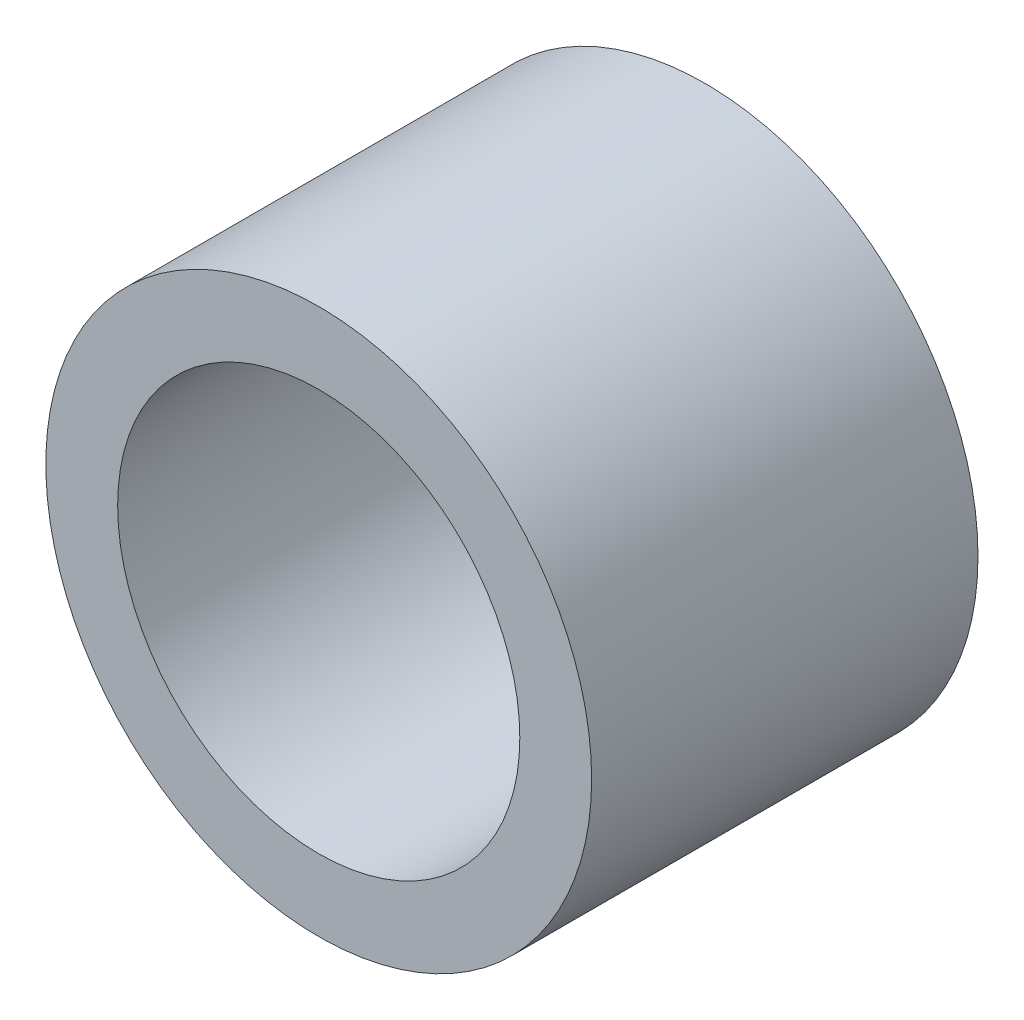
ISO-10303-21;
HEADER;
FILE_DESCRIPTION(('STEP AP214'),'2;1');
FILE_NAME('part.step','',(''),(''),'','','');
FILE_SCHEMA(('AUTOMOTIVE_DESIGN { 1 0 10303 214 1 1 1 1 }'));
ENDSEC;
DATA;
#1=APPLICATION_CONTEXT('core data for automotive mechanical design processes');
#2=APPLICATION_PROTOCOL_DEFINITION('international standard','automotive_design',2000,#1);
#3=PRODUCT_CONTEXT('',#1,'mechanical');
#4=PRODUCT('Part','Part','',(#3));
#5=PRODUCT_RELATED_PRODUCT_CATEGORY('part','',(#4));
#6=PRODUCT_DEFINITION_FORMATION('','',#4);
#7=PRODUCT_DEFINITION_CONTEXT('part definition',#1,'design');
#8=PRODUCT_DEFINITION('design','',#6,#7);
#9=PRODUCT_DEFINITION_SHAPE('','',#8);
#10=(LENGTH_UNIT() NAMED_UNIT(*) SI_UNIT(.MILLI.,.METRE.));
#11=(NAMED_UNIT(*) PLANE_ANGLE_UNIT() SI_UNIT($,.RADIAN.));
#12=(NAMED_UNIT(*) SI_UNIT($,.STERADIAN.) SOLID_ANGLE_UNIT());
#13=UNCERTAINTY_MEASURE_WITH_UNIT(LENGTH_MEASURE(1.E-05),#10,'distance_accuracy_value','');
#14=(GEOMETRIC_REPRESENTATION_CONTEXT(3) GLOBAL_UNCERTAINTY_ASSIGNED_CONTEXT((#13)) GLOBAL_UNIT_ASSIGNED_CONTEXT((#10,
#11,#12)) REPRESENTATION_CONTEXT('',''));
#15=CARTESIAN_POINT('',(0.,0.,0.));
#16=DIRECTION('',(0.,0.,1.));
#17=DIRECTION('',(1.,0.,0.));
#18=AXIS2_PLACEMENT_3D('',#15,#16,#17);
#19=CARTESIAN_POINT('',(0.,0.,6.8326));
#20=DIRECTION('',(0.,0.,1.));
#21=DIRECTION('',(1.,0.,0.));
#22=AXIS2_PLACEMENT_3D('',#19,#20,#21);
#23=PLANE('',#22);
#24=CARTESIAN_POINT('',(0.,0.,6.8326));
#25=DIRECTION('',(0.,0.,1.));
#26=DIRECTION('',(1.,0.,0.));
#27=AXIS2_PLACEMENT_3D('',#24,#25,#26);
#28=CIRCLE('',#27,4.826);
#29=CARTESIAN_POINT('',(4.826,0.,6.8326));
#30=VERTEX_POINT('',#29);
#31=EDGE_CURVE('E10',#30,#30,#28,.T.);
#32=ORIENTED_EDGE('',*,*,#31,.T.);
#33=EDGE_LOOP('',(#32));
#34=FACE_BOUND('',#33,.T.);
#35=CARTESIAN_POINT('',(0.,0.,6.8326));
#36=DIRECTION('',(0.,0.,1.));
#37=DIRECTION('',(1.,0.,0.));
#38=AXIS2_PLACEMENT_3D('',#35,#36,#37);
#39=CIRCLE('',#38,3.556);
#40=CARTESIAN_POINT('',(3.556,0.,6.8326));
#41=VERTEX_POINT('',#40);
#42=EDGE_CURVE('E42',#41,#41,#39,.T.);
#43=ORIENTED_EDGE('',*,*,#42,.F.);
#44=EDGE_LOOP('',(#43));
#45=FACE_BOUND('',#44,.T.);
#46=ADVANCED_FACE('F31',(#34,#45),#23,.T.);
#47=CARTESIAN_POINT('',(0.,0.,0.));
#48=DIRECTION('',(0.,0.,1.));
#49=DIRECTION('',(1.,0.,0.));
#50=AXIS2_PLACEMENT_3D('',#47,#48,#49);
#51=PLANE('',#50);
#52=CARTESIAN_POINT('',(0.,0.,0.));
#53=DIRECTION('',(0.,0.,1.));
#54=DIRECTION('',(1.,0.,0.));
#55=AXIS2_PLACEMENT_3D('',#52,#53,#54);
#56=CIRCLE('',#55,4.826);
#57=CARTESIAN_POINT('',(4.826,0.,0.));
#58=VERTEX_POINT('',#57);
#59=EDGE_CURVE('E35',#58,#58,#56,.T.);
#60=ORIENTED_EDGE('',*,*,#59,.F.);
#61=EDGE_LOOP('',(#60));
#62=FACE_BOUND('',#61,.T.);
#63=CARTESIAN_POINT('',(0.,0.,0.));
#64=DIRECTION('',(0.,0.,1.));
#65=DIRECTION('',(1.,0.,0.));
#66=AXIS2_PLACEMENT_3D('',#63,#64,#65);
#67=CIRCLE('',#66,3.556);
#68=CARTESIAN_POINT('',(3.556,0.,0.));
#69=VERTEX_POINT('',#68);
#70=EDGE_CURVE('E44',#69,#69,#67,.T.);
#71=ORIENTED_EDGE('',*,*,#70,.T.);
#72=EDGE_LOOP('',(#71));
#73=FACE_BOUND('',#72,.T.);
#74=ADVANCED_FACE('F54',(#62,#73),#51,.F.);
#75=CARTESIAN_POINT('',(0.,0.,6.8326));
#76=DIRECTION('',(0.,0.,-1.));
#77=DIRECTION('',(-1.,0.,0.));
#78=AXIS2_PLACEMENT_3D('',#75,#76,#77);
#79=CYLINDRICAL_SURFACE('',#78,4.826);
#80=ORIENTED_EDGE('',*,*,#31,.F.);
#81=EDGE_LOOP('',(#80));
#82=FACE_BOUND('',#81,.T.);
#83=ORIENTED_EDGE('',*,*,#59,.T.);
#84=EDGE_LOOP('',(#83));
#85=FACE_BOUND('',#84,.T.);
#86=ADVANCED_FACE('F33',(#82,#85),#79,.T.);
#87=CARTESIAN_POINT('',(0.,0.,6.8326));
#88=DIRECTION('',(0.,0.,-1.));
#89=DIRECTION('',(-1.,0.,0.));
#90=AXIS2_PLACEMENT_3D('',#87,#88,#89);
#91=CYLINDRICAL_SURFACE('',#90,3.556);
#92=ORIENTED_EDGE('',*,*,#42,.T.);
#93=EDGE_LOOP('',(#92));
#94=FACE_BOUND('',#93,.T.);
#95=ORIENTED_EDGE('',*,*,#70,.F.);
#96=EDGE_LOOP('',(#95));
#97=FACE_BOUND('',#96,.T.);
#98=ADVANCED_FACE('F50',(#94,#97),#91,.F.);
#99=CLOSED_SHELL('',(#46,#74,#86,#98));
#100=MANIFOLD_SOLID_BREP('B2',#99);
#101=ADVANCED_BREP_SHAPE_REPRESENTATION('',(#18,#100),#14);
#102=SHAPE_DEFINITION_REPRESENTATION(#9,#101);
ENDSEC;
END-ISO-10303-21;
